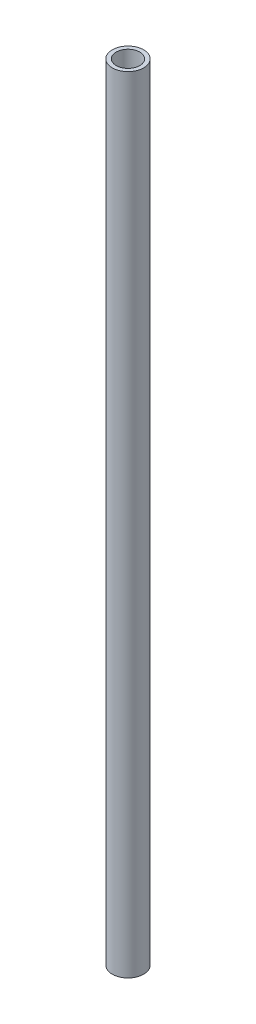
ISO-10303-21;
HEADER;
FILE_DESCRIPTION(('STEP AP214'),'2;1');
FILE_NAME('part.step','',(''),(''),'','','');
FILE_SCHEMA(('AUTOMOTIVE_DESIGN { 1 0 10303 214 1 1 1 1 }'));
ENDSEC;
DATA;
#1=APPLICATION_CONTEXT('core data for automotive mechanical design processes');
#2=APPLICATION_PROTOCOL_DEFINITION('international standard','automotive_design',2000,#1);
#3=PRODUCT_CONTEXT('',#1,'mechanical');
#4=PRODUCT('Part','Part','',(#3));
#5=PRODUCT_RELATED_PRODUCT_CATEGORY('part','',(#4));
#6=PRODUCT_DEFINITION_FORMATION('','',#4);
#7=PRODUCT_DEFINITION_CONTEXT('part definition',#1,'design');
#8=PRODUCT_DEFINITION('design','',#6,#7);
#9=PRODUCT_DEFINITION_SHAPE('','',#8);
#10=(LENGTH_UNIT() NAMED_UNIT(*) SI_UNIT(.MILLI.,.METRE.));
#11=(NAMED_UNIT(*) PLANE_ANGLE_UNIT() SI_UNIT($,.RADIAN.));
#12=(NAMED_UNIT(*) SI_UNIT($,.STERADIAN.) SOLID_ANGLE_UNIT());
#13=UNCERTAINTY_MEASURE_WITH_UNIT(LENGTH_MEASURE(1.E-05),#10,'distance_accuracy_value','');
#14=(GEOMETRIC_REPRESENTATION_CONTEXT(3) GLOBAL_UNCERTAINTY_ASSIGNED_CONTEXT((#13)) GLOBAL_UNIT_ASSIGNED_CONTEXT((#10,
#11,#12)) REPRESENTATION_CONTEXT('',''));
#15=CARTESIAN_POINT('',(0.,0.,0.));
#16=DIRECTION('',(0.,0.,1.));
#17=DIRECTION('',(1.,0.,0.));
#18=AXIS2_PLACEMENT_3D('',#15,#16,#17);
#19=CARTESIAN_POINT('',(0.,1000.,0.));
#20=DIRECTION('',(0.,1.,0.));
#21=DIRECTION('',(0.,0.,1.));
#22=AXIS2_PLACEMENT_3D('',#19,#20,#21);
#23=PLANE('',#22);
#24=CARTESIAN_POINT('',(0.,1000.,0.));
#25=DIRECTION('',(0.,1.,0.));
#26=DIRECTION('',(0.,0.,1.));
#27=AXIS2_PLACEMENT_3D('',#24,#25,#26);
#28=CIRCLE('',#27,20.);
#29=CARTESIAN_POINT('',(0.,1000.,20.));
#30=VERTEX_POINT('',#29);
#31=EDGE_CURVE('E10',#30,#30,#28,.T.);
#32=ORIENTED_EDGE('',*,*,#31,.T.);
#33=EDGE_LOOP('',(#32));
#34=FACE_BOUND('',#33,.T.);
#35=CARTESIAN_POINT('',(0.,1000.,0.));
#36=DIRECTION('',(0.,1.,0.));
#37=DIRECTION('',(0.,0.,1.));
#38=AXIS2_PLACEMENT_3D('',#35,#36,#37);
#39=CIRCLE('',#38,15.);
#40=CARTESIAN_POINT('',(0.,1000.,15.));
#41=VERTEX_POINT('',#40);
#42=EDGE_CURVE('E40',#41,#41,#39,.T.);
#43=ORIENTED_EDGE('',*,*,#42,.F.);
#44=EDGE_LOOP('',(#43));
#45=FACE_BOUND('',#44,.T.);
#46=ADVANCED_FACE('F29',(#34,#45),#23,.T.);
#47=CARTESIAN_POINT('',(0.,0.,0.));
#48=DIRECTION('',(0.,1.,0.));
#49=DIRECTION('',(0.,0.,1.));
#50=AXIS2_PLACEMENT_3D('',#47,#48,#49);
#51=PLANE('',#50);
#52=CARTESIAN_POINT('',(0.,0.,0.));
#53=DIRECTION('',(0.,1.,0.));
#54=DIRECTION('',(0.,0.,1.));
#55=AXIS2_PLACEMENT_3D('',#52,#53,#54);
#56=CIRCLE('',#55,20.);
#57=CARTESIAN_POINT('',(0.,0.,20.));
#58=VERTEX_POINT('',#57);
#59=EDGE_CURVE('E36',#58,#58,#56,.T.);
#60=ORIENTED_EDGE('',*,*,#59,.F.);
#61=EDGE_LOOP('',(#60));
#62=FACE_BOUND('',#61,.T.);
#63=CARTESIAN_POINT('',(0.,0.,0.));
#64=DIRECTION('',(0.,1.,0.));
#65=DIRECTION('',(0.,0.,1.));
#66=AXIS2_PLACEMENT_3D('',#63,#64,#65);
#67=CIRCLE('',#66,15.);
#68=CARTESIAN_POINT('',(0.,0.,15.));
#69=VERTEX_POINT('',#68);
#70=EDGE_CURVE('E44',#69,#69,#67,.T.);
#71=ORIENTED_EDGE('',*,*,#70,.T.);
#72=EDGE_LOOP('',(#71));
#73=FACE_BOUND('',#72,.T.);
#74=ADVANCED_FACE('F50',(#62,#73),#51,.F.);
#75=CARTESIAN_POINT('',(0.,1000.,0.));
#76=DIRECTION('',(0.,-1.,0.));
#77=DIRECTION('',(0.,0.,-1.));
#78=AXIS2_PLACEMENT_3D('',#75,#76,#77);
#79=CYLINDRICAL_SURFACE('',#78,20.);
#80=ORIENTED_EDGE('',*,*,#31,.F.);
#81=EDGE_LOOP('',(#80));
#82=FACE_BOUND('',#81,.T.);
#83=ORIENTED_EDGE('',*,*,#59,.T.);
#84=EDGE_LOOP('',(#83));
#85=FACE_BOUND('',#84,.T.);
#86=ADVANCED_FACE('F31',(#82,#85),#79,.T.);
#87=CARTESIAN_POINT('',(0.,1000.,0.));
#88=DIRECTION('',(0.,-1.,0.));
#89=DIRECTION('',(0.,0.,-1.));
#90=AXIS2_PLACEMENT_3D('',#87,#88,#89);
#91=CYLINDRICAL_SURFACE('',#90,15.);
#92=ORIENTED_EDGE('',*,*,#42,.T.);
#93=EDGE_LOOP('',(#92));
#94=FACE_BOUND('',#93,.T.);
#95=ORIENTED_EDGE('',*,*,#70,.F.);
#96=EDGE_LOOP('',(#95));
#97=FACE_BOUND('',#96,.T.);
#98=ADVANCED_FACE('F52',(#94,#97),#91,.F.);
#99=CLOSED_SHELL('',(#46,#74,#86,#98));
#100=MANIFOLD_SOLID_BREP('B2',#99);
#101=ADVANCED_BREP_SHAPE_REPRESENTATION('',(#18,#100),#14);
#102=SHAPE_DEFINITION_REPRESENTATION(#9,#101);
ENDSEC;
END-ISO-10303-21;
